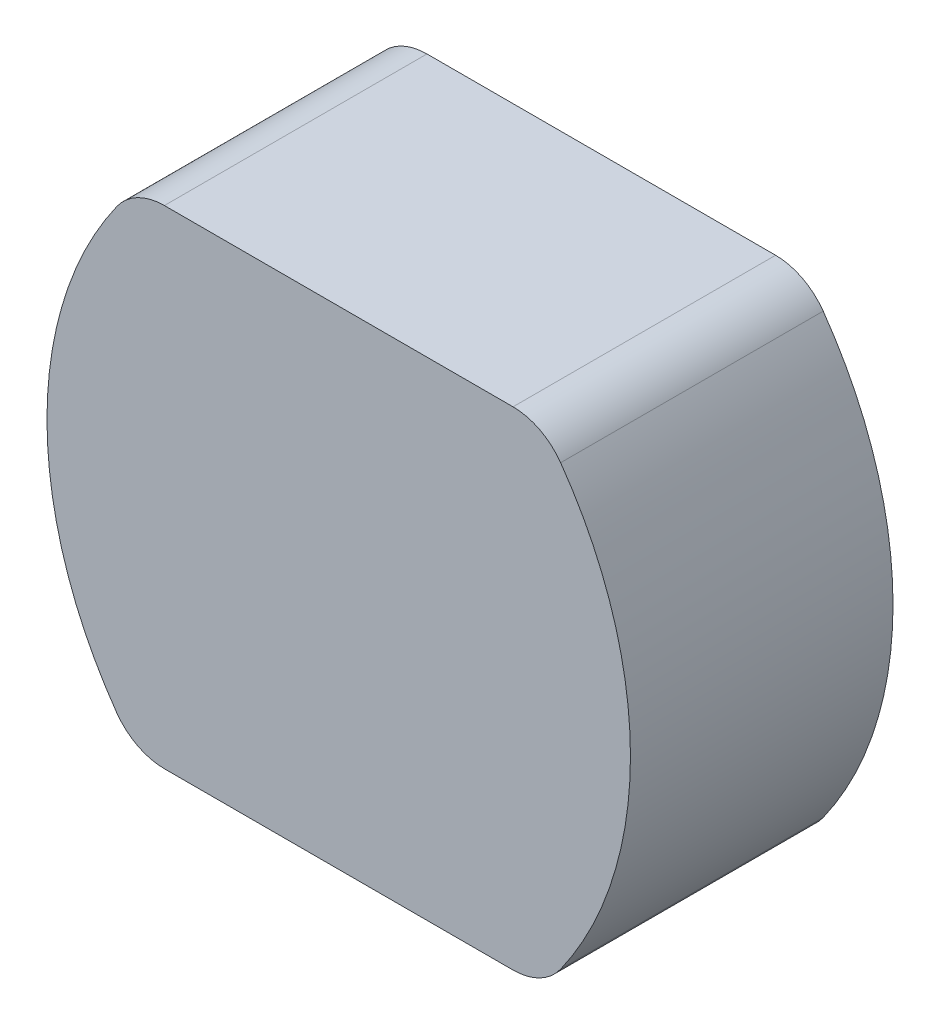
ISO-10303-21;
HEADER;
FILE_DESCRIPTION(('STEP AP214'),'2;1');
FILE_NAME('part.step','',(''),(''),'','','');
FILE_SCHEMA(('AUTOMOTIVE_DESIGN { 1 0 10303 214 1 1 1 1 }'));
ENDSEC;
DATA;
#1=APPLICATION_CONTEXT('core data for automotive mechanical design processes');
#2=APPLICATION_PROTOCOL_DEFINITION('international standard','automotive_design',2000,#1);
#3=PRODUCT_CONTEXT('',#1,'mechanical');
#4=PRODUCT('Part','Part','',(#3));
#5=PRODUCT_RELATED_PRODUCT_CATEGORY('part','',(#4));
#6=PRODUCT_DEFINITION_FORMATION('','',#4);
#7=PRODUCT_DEFINITION_CONTEXT('part definition',#1,'design');
#8=PRODUCT_DEFINITION('design','',#6,#7);
#9=PRODUCT_DEFINITION_SHAPE('','',#8);
#10=(LENGTH_UNIT() NAMED_UNIT(*) SI_UNIT(.MILLI.,.METRE.));
#11=(NAMED_UNIT(*) PLANE_ANGLE_UNIT() SI_UNIT($,.RADIAN.));
#12=(NAMED_UNIT(*) SI_UNIT($,.STERADIAN.) SOLID_ANGLE_UNIT());
#13=UNCERTAINTY_MEASURE_WITH_UNIT(LENGTH_MEASURE(1.E-05),#10,'distance_accuracy_value','');
#14=(GEOMETRIC_REPRESENTATION_CONTEXT(3) GLOBAL_UNCERTAINTY_ASSIGNED_CONTEXT((#13)) GLOBAL_UNIT_ASSIGNED_CONTEXT((#10,
#11,#12)) REPRESENTATION_CONTEXT('',''));
#15=CARTESIAN_POINT('',(0.,0.,0.));
#16=DIRECTION('',(0.,0.,1.));
#17=DIRECTION('',(1.,0.,0.));
#18=AXIS2_PLACEMENT_3D('',#15,#16,#17);
#19=CARTESIAN_POINT('',(3.,0.,9.));
#20=DIRECTION('',(0.,0.,-1.));
#21=DIRECTION('',(-1.,0.,0.));
#22=AXIS2_PLACEMENT_3D('',#19,#20,#21);
#23=CYLINDRICAL_SURFACE('',#22,13.);
#24=CARTESIAN_POINT('',(3.,0.,0.));
#25=DIRECTION('',(0.,0.,1.));
#26=DIRECTION('',(1.,0.,0.));
#27=AXIS2_PLACEMENT_3D('',#24,#25,#26);
#28=CIRCLE('',#27,13.);
#29=CARTESIAN_POINT('',(-7.6068033679309,-7.51636363636364,0.));
#30=VERTEX_POINT('',#29);
#31=CARTESIAN_POINT('',(-7.60680336793091,7.51636363636363,0.));
#32=VERTEX_POINT('',#31);
#33=EDGE_CURVE('E105',#30,#32,#28,.F.);
#34=ORIENTED_EDGE('',*,*,#33,.F.);
#35=DIRECTION('',(0.,0.,-1.));
#36=VECTOR('',#35,1.);
#37=CARTESIAN_POINT('',(-7.6068033679309,-7.51636363636364,9.));
#38=LINE('',#37,#36);
#39=CARTESIAN_POINT('',(-7.6068033679309,-7.51636363636364,9.));
#40=VERTEX_POINT('',#39);
#41=EDGE_CURVE('E55',#30,#40,#38,.F.);
#42=ORIENTED_EDGE('',*,*,#41,.T.);
#43=CARTESIAN_POINT('',(3.,0.,9.));
#44=DIRECTION('',(0.,0.,1.));
#45=DIRECTION('',(1.,0.,0.));
#46=AXIS2_PLACEMENT_3D('',#43,#44,#45);
#47=CIRCLE('',#46,13.);
#48=CARTESIAN_POINT('',(-7.60680336793091,7.51636363636363,9.));
#49=VERTEX_POINT('',#48);
#50=EDGE_CURVE('E120',#40,#49,#47,.F.);
#51=ORIENTED_EDGE('',*,*,#50,.T.);
#52=DIRECTION('',(0.,0.,-1.));
#53=VECTOR('',#52,1.);
#54=CARTESIAN_POINT('',(-7.60680336793091,7.51636363636363,9.));
#55=LINE('',#54,#53);
#56=EDGE_CURVE('E141',#49,#32,#55,.T.);
#57=ORIENTED_EDGE('',*,*,#56,.T.);
#58=EDGE_LOOP('',(#34,#42,#51,#57));
#59=FACE_BOUND('',#58,.T.);
#60=ADVANCED_FACE('F32',(#59),#23,.T.);
#61=CARTESIAN_POINT('',(0.,-8.36,9.));
#62=DIRECTION('',(0.,1.,0.));
#63=DIRECTION('',(-1.,0.,0.));
#64=AXIS2_PLACEMENT_3D('',#61,#62,#63);
#65=PLANE('',#64);
#66=DIRECTION('',(1.,0.,0.));
#67=VECTOR('',#66,1.);
#68=CARTESIAN_POINT('',(0.,-8.36,9.));
#69=LINE('',#68,#67);
#70=CARTESIAN_POINT('',(-5.9749874651723,-8.36,9.));
#71=VERTEX_POINT('',#70);
#72=CARTESIAN_POINT('',(5.97498746517231,-8.36,9.));
#73=VERTEX_POINT('',#72);
#74=EDGE_CURVE('E156',#71,#73,#69,.T.);
#75=ORIENTED_EDGE('',*,*,#74,.F.);
#76=DIRECTION('',(0.,0.,1.));
#77=VECTOR('',#76,1.);
#78=CARTESIAN_POINT('',(-5.9749874651723,-8.36,0.));
#79=LINE('',#78,#77);
#80=CARTESIAN_POINT('',(-5.9749874651723,-8.36,0.));
#81=VERTEX_POINT('',#80);
#82=EDGE_CURVE('E145',#71,#81,#79,.F.);
#83=ORIENTED_EDGE('',*,*,#82,.T.);
#84=DIRECTION('',(1.,0.,0.));
#85=VECTOR('',#84,1.);
#86=CARTESIAN_POINT('',(0.,-8.36,0.));
#87=LINE('',#86,#85);
#88=CARTESIAN_POINT('',(5.97498746517231,-8.36,0.));
#89=VERTEX_POINT('',#88);
#90=EDGE_CURVE('E165',#81,#89,#87,.T.);
#91=ORIENTED_EDGE('',*,*,#90,.T.);
#92=DIRECTION('',(0.,0.,-1.));
#93=VECTOR('',#92,1.);
#94=CARTESIAN_POINT('',(5.97498746517231,-8.36,9.));
#95=LINE('',#94,#93);
#96=EDGE_CURVE('E143',#89,#73,#95,.F.);
#97=ORIENTED_EDGE('',*,*,#96,.T.);
#98=EDGE_LOOP('',(#75,#83,#91,#97));
#99=FACE_BOUND('',#98,.T.);
#100=ADVANCED_FACE('F160',(#99),#65,.F.);
#101=CARTESIAN_POINT('',(-3.,0.,9.));
#102=DIRECTION('',(0.,0.,-1.));
#103=DIRECTION('',(-1.,0.,0.));
#104=AXIS2_PLACEMENT_3D('',#101,#102,#103);
#105=CYLINDRICAL_SURFACE('',#104,13.);
#106=CARTESIAN_POINT('',(-3.,0.,9.));
#107=DIRECTION('',(0.,0.,1.));
#108=DIRECTION('',(1.,0.,0.));
#109=AXIS2_PLACEMENT_3D('',#106,#107,#108);
#110=CIRCLE('',#109,13.);
#111=CARTESIAN_POINT('',(7.60680336793091,-7.51636363636364,9.));
#112=VERTEX_POINT('',#111);
#113=CARTESIAN_POINT('',(7.60680336793091,7.51636363636364,9.));
#114=VERTEX_POINT('',#113);
#115=EDGE_CURVE('E130',#112,#114,#110,.T.);
#116=ORIENTED_EDGE('',*,*,#115,.F.);
#117=DIRECTION('',(0.,0.,-1.));
#118=VECTOR('',#117,1.);
#119=CARTESIAN_POINT('',(7.60680336793091,-7.51636363636364,9.));
#120=LINE('',#119,#118);
#121=CARTESIAN_POINT('',(7.60680336793091,-7.51636363636364,0.));
#122=VERTEX_POINT('',#121);
#123=EDGE_CURVE('E11',#112,#122,#120,.T.);
#124=ORIENTED_EDGE('',*,*,#123,.T.);
#125=CARTESIAN_POINT('',(-3.,0.,0.));
#126=DIRECTION('',(0.,0.,1.));
#127=DIRECTION('',(1.,0.,0.));
#128=AXIS2_PLACEMENT_3D('',#125,#126,#127);
#129=CIRCLE('',#128,13.);
#130=CARTESIAN_POINT('',(7.60680336793091,7.51636363636364,0.));
#131=VERTEX_POINT('',#130);
#132=EDGE_CURVE('E121',#122,#131,#129,.T.);
#133=ORIENTED_EDGE('',*,*,#132,.T.);
#134=DIRECTION('',(0.,0.,-1.));
#135=VECTOR('',#134,1.);
#136=CARTESIAN_POINT('',(7.60680336793091,7.51636363636364,9.));
#137=LINE('',#136,#135);
#138=EDGE_CURVE('E135',#131,#114,#137,.F.);
#139=ORIENTED_EDGE('',*,*,#138,.T.);
#140=EDGE_LOOP('',(#116,#124,#133,#139));
#141=FACE_BOUND('',#140,.T.);
#142=ADVANCED_FACE('F171',(#141),#105,.T.);
#143=CARTESIAN_POINT('',(0.,8.36,9.));
#144=DIRECTION('',(0.,1.,0.));
#145=DIRECTION('',(-1.,0.,0.));
#146=AXIS2_PLACEMENT_3D('',#143,#144,#145);
#147=PLANE('',#146);
#148=DIRECTION('',(1.,0.,0.));
#149=VECTOR('',#148,1.);
#150=CARTESIAN_POINT('',(0.,8.36,9.));
#151=LINE('',#150,#149);
#152=CARTESIAN_POINT('',(-5.97498746517231,8.36,9.));
#153=VERTEX_POINT('',#152);
#154=CARTESIAN_POINT('',(5.97498746517231,8.36,9.));
#155=VERTEX_POINT('',#154);
#156=EDGE_CURVE('E127',#153,#155,#151,.T.);
#157=ORIENTED_EDGE('',*,*,#156,.T.);
#158=DIRECTION('',(0.,0.,1.));
#159=VECTOR('',#158,1.);
#160=CARTESIAN_POINT('',(5.97498746517231,8.36,0.));
#161=LINE('',#160,#159);
#162=CARTESIAN_POINT('',(5.97498746517231,8.36,0.));
#163=VERTEX_POINT('',#162);
#164=EDGE_CURVE('E111',#155,#163,#161,.F.);
#165=ORIENTED_EDGE('',*,*,#164,.T.);
#166=DIRECTION('',(1.,0.,0.));
#167=VECTOR('',#166,1.);
#168=CARTESIAN_POINT('',(0.,8.36,0.));
#169=LINE('',#168,#167);
#170=CARTESIAN_POINT('',(-5.97498746517231,8.36,0.));
#171=VERTEX_POINT('',#170);
#172=EDGE_CURVE('E104',#171,#163,#169,.T.);
#173=ORIENTED_EDGE('',*,*,#172,.F.);
#174=DIRECTION('',(0.,0.,-1.));
#175=VECTOR('',#174,1.);
#176=CARTESIAN_POINT('',(-5.97498746517231,8.36,9.));
#177=LINE('',#176,#175);
#178=EDGE_CURVE('E117',#171,#153,#177,.F.);
#179=ORIENTED_EDGE('',*,*,#178,.T.);
#180=EDGE_LOOP('',(#157,#165,#173,#179));
#181=FACE_BOUND('',#180,.T.);
#182=ADVANCED_FACE('F116',(#181),#147,.T.);
#183=CARTESIAN_POINT('',(0.,0.,9.));
#184=DIRECTION('',(0.,0.,1.));
#185=DIRECTION('',(1.,0.,0.));
#186=AXIS2_PLACEMENT_3D('',#183,#184,#185);
#187=PLANE('',#186);
#188=ORIENTED_EDGE('',*,*,#50,.F.);
#189=CARTESIAN_POINT('',(-5.9749874651723,-6.36,9.));
#190=DIRECTION('',(0.,0.,1.));
#191=DIRECTION('',(1.,0.,0.));
#192=AXIS2_PLACEMENT_3D('',#189,#190,#191);
#193=CIRCLE('',#192,2.);
#194=EDGE_CURVE('E40',#40,#71,#193,.T.);
#195=ORIENTED_EDGE('',*,*,#194,.T.);
#196=ORIENTED_EDGE('',*,*,#74,.T.);
#197=CARTESIAN_POINT('',(5.97498746517231,-6.36,9.));
#198=DIRECTION('',(0.,0.,1.));
#199=DIRECTION('',(1.,0.,0.));
#200=AXIS2_PLACEMENT_3D('',#197,#198,#199);
#201=CIRCLE('',#200,2.);
#202=EDGE_CURVE('E47',#73,#112,#201,.T.);
#203=ORIENTED_EDGE('',*,*,#202,.T.);
#204=ORIENTED_EDGE('',*,*,#115,.T.);
#205=CARTESIAN_POINT('',(5.97498746517231,6.36,9.));
#206=DIRECTION('',(0.,0.,1.));
#207=DIRECTION('',(1.,0.,0.));
#208=AXIS2_PLACEMENT_3D('',#205,#206,#207);
#209=CIRCLE('',#208,2.);
#210=EDGE_CURVE('E139',#114,#155,#209,.T.);
#211=ORIENTED_EDGE('',*,*,#210,.T.);
#212=ORIENTED_EDGE('',*,*,#156,.F.);
#213=CARTESIAN_POINT('',(-5.97498746517231,6.36,9.));
#214=DIRECTION('',(0.,0.,1.));
#215=DIRECTION('',(1.,0.,0.));
#216=AXIS2_PLACEMENT_3D('',#213,#214,#215);
#217=CIRCLE('',#216,2.);
#218=EDGE_CURVE('E126',#153,#49,#217,.T.);
#219=ORIENTED_EDGE('',*,*,#218,.T.);
#220=EDGE_LOOP('',(#188,#195,#196,#203,#204,#211,#212,#219));
#221=FACE_BOUND('',#220,.T.);
#222=ADVANCED_FACE('F155',(#221),#187,.T.);
#223=CARTESIAN_POINT('',(0.,0.,0.));
#224=DIRECTION('',(0.,0.,1.));
#225=DIRECTION('',(1.,0.,0.));
#226=AXIS2_PLACEMENT_3D('',#223,#224,#225);
#227=PLANE('',#226);
#228=ORIENTED_EDGE('',*,*,#90,.F.);
#229=CARTESIAN_POINT('',(-5.9749874651723,-6.36,0.));
#230=DIRECTION('',(0.,0.,1.));
#231=DIRECTION('',(1.,0.,0.));
#232=AXIS2_PLACEMENT_3D('',#229,#230,#231);
#233=CIRCLE('',#232,2.);
#234=EDGE_CURVE('E150',#81,#30,#233,.F.);
#235=ORIENTED_EDGE('',*,*,#234,.T.);
#236=ORIENTED_EDGE('',*,*,#33,.T.);
#237=CARTESIAN_POINT('',(-5.97498746517231,6.36,0.));
#238=DIRECTION('',(0.,0.,1.));
#239=DIRECTION('',(1.,0.,0.));
#240=AXIS2_PLACEMENT_3D('',#237,#238,#239);
#241=CIRCLE('',#240,2.);
#242=EDGE_CURVE('E99',#32,#171,#241,.F.);
#243=ORIENTED_EDGE('',*,*,#242,.T.);
#244=ORIENTED_EDGE('',*,*,#172,.T.);
#245=CARTESIAN_POINT('',(5.97498746517231,6.36,0.));
#246=DIRECTION('',(0.,0.,1.));
#247=DIRECTION('',(1.,0.,0.));
#248=AXIS2_PLACEMENT_3D('',#245,#246,#247);
#249=CIRCLE('',#248,2.);
#250=EDGE_CURVE('E110',#163,#131,#249,.F.);
#251=ORIENTED_EDGE('',*,*,#250,.T.);
#252=ORIENTED_EDGE('',*,*,#132,.F.);
#253=CARTESIAN_POINT('',(5.97498746517231,-6.36,0.));
#254=DIRECTION('',(0.,0.,1.));
#255=DIRECTION('',(1.,0.,0.));
#256=AXIS2_PLACEMENT_3D('',#253,#254,#255);
#257=CIRCLE('',#256,2.);
#258=EDGE_CURVE('E148',#122,#89,#257,.F.);
#259=ORIENTED_EDGE('',*,*,#258,.T.);
#260=EDGE_LOOP('',(#228,#235,#236,#243,#244,#251,#252,#259));
#261=FACE_BOUND('',#260,.T.);
#262=ADVANCED_FACE('F102',(#261),#227,.F.);
#263=CARTESIAN_POINT('',(5.97498746517231,6.36,9.));
#264=DIRECTION('',(0.,0.,-1.));
#265=DIRECTION('',(-1.,0.,0.));
#266=AXIS2_PLACEMENT_3D('',#263,#264,#265);
#267=CYLINDRICAL_SURFACE('',#266,2.);
#268=ORIENTED_EDGE('',*,*,#210,.F.);
#269=ORIENTED_EDGE('',*,*,#138,.F.);
#270=ORIENTED_EDGE('',*,*,#250,.F.);
#271=ORIENTED_EDGE('',*,*,#164,.F.);
#272=EDGE_LOOP('',(#268,#269,#270,#271));
#273=FACE_BOUND('',#272,.T.);
#274=ADVANCED_FACE('F176',(#273),#267,.T.);
#275=CARTESIAN_POINT('',(-5.97498746517231,6.36,9.));
#276=DIRECTION('',(0.,0.,-1.));
#277=DIRECTION('',(-1.,0.,0.));
#278=AXIS2_PLACEMENT_3D('',#275,#276,#277);
#279=CYLINDRICAL_SURFACE('',#278,2.);
#280=ORIENTED_EDGE('',*,*,#218,.F.);
#281=ORIENTED_EDGE('',*,*,#178,.F.);
#282=ORIENTED_EDGE('',*,*,#242,.F.);
#283=ORIENTED_EDGE('',*,*,#56,.F.);
#284=EDGE_LOOP('',(#280,#281,#282,#283));
#285=FACE_BOUND('',#284,.T.);
#286=ADVANCED_FACE('F124',(#285),#279,.T.);
#287=CARTESIAN_POINT('',(-5.9749874651723,-6.36,9.));
#288=DIRECTION('',(0.,0.,-1.));
#289=DIRECTION('',(-1.,0.,0.));
#290=AXIS2_PLACEMENT_3D('',#287,#288,#289);
#291=CYLINDRICAL_SURFACE('',#290,2.);
#292=ORIENTED_EDGE('',*,*,#194,.F.);
#293=ORIENTED_EDGE('',*,*,#41,.F.);
#294=ORIENTED_EDGE('',*,*,#234,.F.);
#295=ORIENTED_EDGE('',*,*,#82,.F.);
#296=EDGE_LOOP('',(#292,#293,#294,#295));
#297=FACE_BOUND('',#296,.T.);
#298=ADVANCED_FACE('F164',(#297),#291,.T.);
#299=CARTESIAN_POINT('',(5.97498746517231,-6.36,9.));
#300=DIRECTION('',(0.,0.,-1.));
#301=DIRECTION('',(-1.,0.,0.));
#302=AXIS2_PLACEMENT_3D('',#299,#300,#301);
#303=CYLINDRICAL_SURFACE('',#302,2.);
#304=ORIENTED_EDGE('',*,*,#202,.F.);
#305=ORIENTED_EDGE('',*,*,#96,.F.);
#306=ORIENTED_EDGE('',*,*,#258,.F.);
#307=ORIENTED_EDGE('',*,*,#123,.F.);
#308=EDGE_LOOP('',(#304,#305,#306,#307));
#309=FACE_BOUND('',#308,.T.);
#310=ADVANCED_FACE('F34',(#309),#303,.T.);
#311=CLOSED_SHELL('',(#60,#100,#142,#182,#222,#262,#274,#286,#298,#310));
#312=MANIFOLD_SOLID_BREP('B2',#311);
#313=ADVANCED_BREP_SHAPE_REPRESENTATION('',(#18,#312),#14);
#314=SHAPE_DEFINITION_REPRESENTATION(#9,#313);
ENDSEC;
END-ISO-10303-21;
